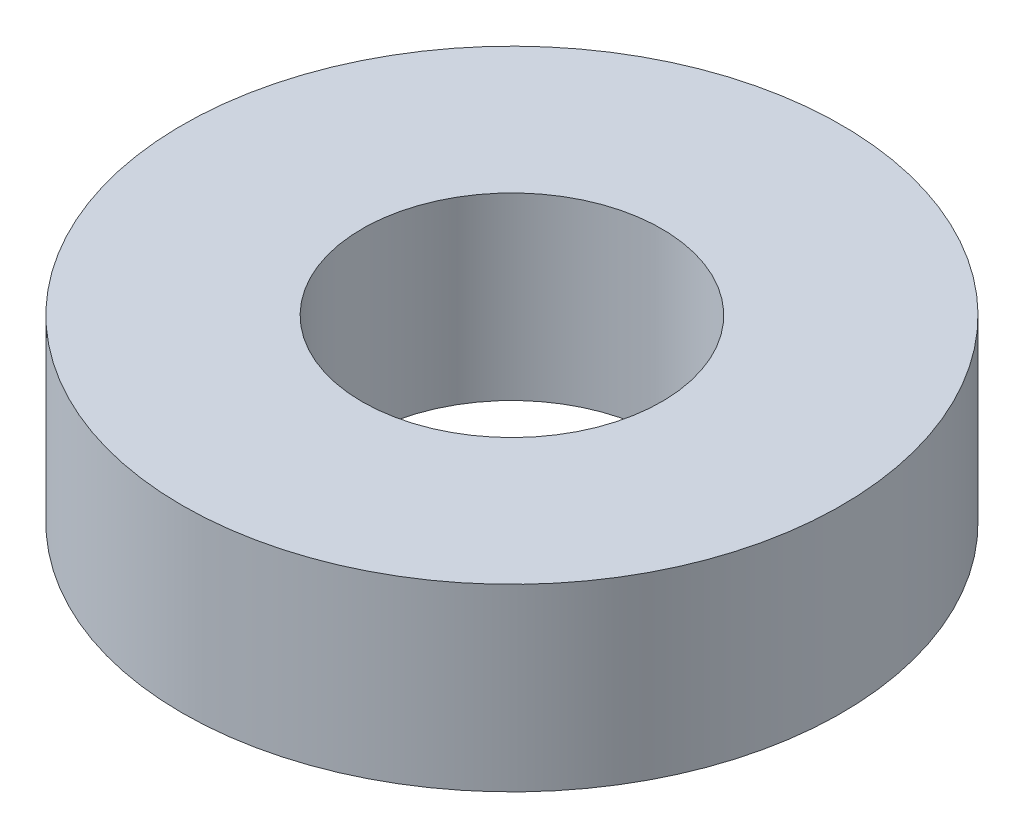
ISO-10303-21;
HEADER;
FILE_DESCRIPTION(('STEP AP214'),'2;1');
FILE_NAME('part.step','',(''),(''),'','','');
FILE_SCHEMA(('AUTOMOTIVE_DESIGN { 1 0 10303 214 1 1 1 1 }'));
ENDSEC;
DATA;
#1=APPLICATION_CONTEXT('core data for automotive mechanical design processes');
#2=APPLICATION_PROTOCOL_DEFINITION('international standard','automotive_design',2000,#1);
#3=PRODUCT_CONTEXT('',#1,'mechanical');
#4=PRODUCT('Part','Part','',(#3));
#5=PRODUCT_RELATED_PRODUCT_CATEGORY('part','',(#4));
#6=PRODUCT_DEFINITION_FORMATION('','',#4);
#7=PRODUCT_DEFINITION_CONTEXT('part definition',#1,'design');
#8=PRODUCT_DEFINITION('design','',#6,#7);
#9=PRODUCT_DEFINITION_SHAPE('','',#8);
#10=(LENGTH_UNIT() NAMED_UNIT(*) SI_UNIT(.MILLI.,.METRE.));
#11=(NAMED_UNIT(*) PLANE_ANGLE_UNIT() SI_UNIT($,.RADIAN.));
#12=(NAMED_UNIT(*) SI_UNIT($,.STERADIAN.) SOLID_ANGLE_UNIT());
#13=UNCERTAINTY_MEASURE_WITH_UNIT(LENGTH_MEASURE(1.E-05),#10,'distance_accuracy_value','');
#14=(GEOMETRIC_REPRESENTATION_CONTEXT(3) GLOBAL_UNCERTAINTY_ASSIGNED_CONTEXT((#13)) GLOBAL_UNIT_ASSIGNED_CONTEXT((#10,
#11,#12)) REPRESENTATION_CONTEXT('',''));
#15=CARTESIAN_POINT('',(0.,0.,0.));
#16=DIRECTION('',(0.,0.,1.));
#17=DIRECTION('',(1.,0.,0.));
#18=AXIS2_PLACEMENT_3D('',#15,#16,#17);
#19=CARTESIAN_POINT('',(0.,6.,0.));
#20=DIRECTION('',(0.,1.,0.));
#21=DIRECTION('',(0.,0.,1.));
#22=AXIS2_PLACEMENT_3D('',#19,#20,#21);
#23=PLANE('',#22);
#24=CARTESIAN_POINT('',(0.,6.,0.));
#25=DIRECTION('',(0.,1.,0.));
#26=DIRECTION('',(0.,0.,1.));
#27=AXIS2_PLACEMENT_3D('',#24,#25,#26);
#28=CIRCLE('',#27,11.);
#29=CARTESIAN_POINT('',(0.,6.,11.));
#30=VERTEX_POINT('',#29);
#31=EDGE_CURVE('E10',#30,#30,#28,.T.);
#32=ORIENTED_EDGE('',*,*,#31,.T.);
#33=EDGE_LOOP('',(#32));
#34=FACE_BOUND('',#33,.T.);
#35=CARTESIAN_POINT('',(0.,6.,0.));
#36=DIRECTION('',(0.,1.,0.));
#37=DIRECTION('',(0.,0.,1.));
#38=AXIS2_PLACEMENT_3D('',#35,#36,#37);
#39=CIRCLE('',#38,5.);
#40=CARTESIAN_POINT('',(0.,6.,5.));
#41=VERTEX_POINT('',#40);
#42=EDGE_CURVE('E43',#41,#41,#39,.T.);
#43=ORIENTED_EDGE('',*,*,#42,.F.);
#44=EDGE_LOOP('',(#43));
#45=FACE_BOUND('',#44,.T.);
#46=ADVANCED_FACE('F32',(#34,#45),#23,.T.);
#47=CARTESIAN_POINT('',(0.,0.,0.));
#48=DIRECTION('',(0.,1.,0.));
#49=DIRECTION('',(0.,0.,1.));
#50=AXIS2_PLACEMENT_3D('',#47,#48,#49);
#51=PLANE('',#50);
#52=CARTESIAN_POINT('',(0.,0.,0.));
#53=DIRECTION('',(0.,1.,0.));
#54=DIRECTION('',(0.,0.,1.));
#55=AXIS2_PLACEMENT_3D('',#52,#53,#54);
#56=CIRCLE('',#55,11.);
#57=CARTESIAN_POINT('',(0.,0.,11.));
#58=VERTEX_POINT('',#57);
#59=EDGE_CURVE('E36',#58,#58,#56,.T.);
#60=ORIENTED_EDGE('',*,*,#59,.F.);
#61=EDGE_LOOP('',(#60));
#62=FACE_BOUND('',#61,.T.);
#63=CARTESIAN_POINT('',(0.,0.,0.));
#64=DIRECTION('',(0.,1.,0.));
#65=DIRECTION('',(0.,0.,1.));
#66=AXIS2_PLACEMENT_3D('',#63,#64,#65);
#67=CIRCLE('',#66,5.);
#68=CARTESIAN_POINT('',(0.,0.,5.));
#69=VERTEX_POINT('',#68);
#70=EDGE_CURVE('E45',#69,#69,#67,.T.);
#71=ORIENTED_EDGE('',*,*,#70,.T.);
#72=EDGE_LOOP('',(#71));
#73=FACE_BOUND('',#72,.T.);
#74=ADVANCED_FACE('F55',(#62,#73),#51,.F.);
#75=CARTESIAN_POINT('',(0.,6.,0.));
#76=DIRECTION('',(0.,-1.,0.));
#77=DIRECTION('',(0.,0.,-1.));
#78=AXIS2_PLACEMENT_3D('',#75,#76,#77);
#79=CYLINDRICAL_SURFACE('',#78,11.);
#80=ORIENTED_EDGE('',*,*,#31,.F.);
#81=EDGE_LOOP('',(#80));
#82=FACE_BOUND('',#81,.T.);
#83=ORIENTED_EDGE('',*,*,#59,.T.);
#84=EDGE_LOOP('',(#83));
#85=FACE_BOUND('',#84,.T.);
#86=ADVANCED_FACE('F34',(#82,#85),#79,.T.);
#87=CARTESIAN_POINT('',(0.,6.,0.));
#88=DIRECTION('',(0.,-1.,0.));
#89=DIRECTION('',(0.,0.,-1.));
#90=AXIS2_PLACEMENT_3D('',#87,#88,#89);
#91=CYLINDRICAL_SURFACE('',#90,5.);
#92=ORIENTED_EDGE('',*,*,#42,.T.);
#93=EDGE_LOOP('',(#92));
#94=FACE_BOUND('',#93,.T.);
#95=ORIENTED_EDGE('',*,*,#70,.F.);
#96=EDGE_LOOP('',(#95));
#97=FACE_BOUND('',#96,.T.);
#98=ADVANCED_FACE('F51',(#94,#97),#91,.F.);
#99=CLOSED_SHELL('',(#46,#74,#86,#98));
#100=MANIFOLD_SOLID_BREP('B2',#99);
#101=ADVANCED_BREP_SHAPE_REPRESENTATION('',(#18,#100),#14);
#102=SHAPE_DEFINITION_REPRESENTATION(#9,#101);
ENDSEC;
END-ISO-10303-21;
